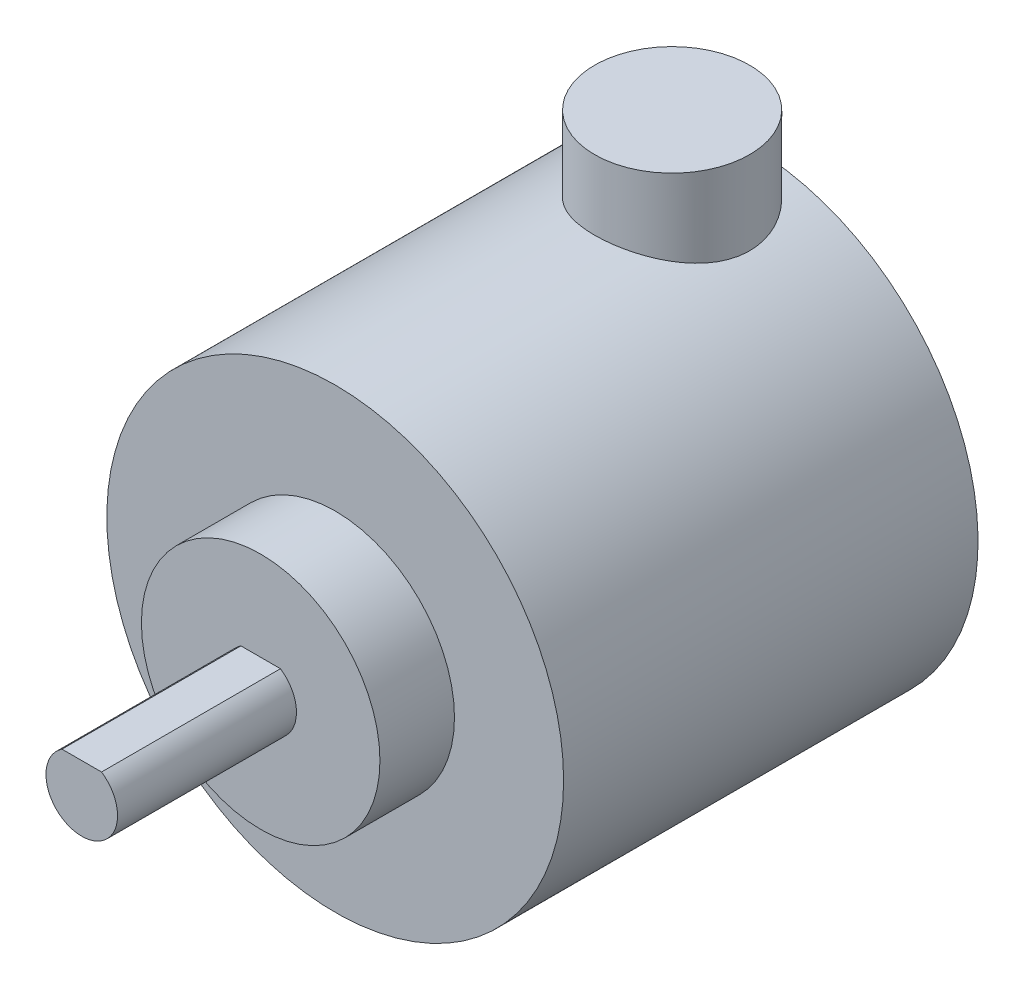
ISO-10303-21;
HEADER;
FILE_DESCRIPTION(('STEP AP214'),'2;1');
FILE_NAME('part.step','',(''),(''),'','','');
FILE_SCHEMA(('AUTOMOTIVE_DESIGN { 1 0 10303 214 1 1 1 1 }'));
ENDSEC;
DATA;
#1=APPLICATION_CONTEXT('core data for automotive mechanical design processes');
#2=APPLICATION_PROTOCOL_DEFINITION('international standard','automotive_design',2000,#1);
#3=PRODUCT_CONTEXT('',#1,'mechanical');
#4=PRODUCT('Part','Part','',(#3));
#5=PRODUCT_RELATED_PRODUCT_CATEGORY('part','',(#4));
#6=PRODUCT_DEFINITION_FORMATION('','',#4);
#7=PRODUCT_DEFINITION_CONTEXT('part definition',#1,'design');
#8=PRODUCT_DEFINITION('design','',#6,#7);
#9=PRODUCT_DEFINITION_SHAPE('','',#8);
#10=(LENGTH_UNIT() NAMED_UNIT(*) SI_UNIT(.MILLI.,.METRE.));
#11=(NAMED_UNIT(*) PLANE_ANGLE_UNIT() SI_UNIT($,.RADIAN.));
#12=(NAMED_UNIT(*) SI_UNIT($,.STERADIAN.) SOLID_ANGLE_UNIT());
#13=UNCERTAINTY_MEASURE_WITH_UNIT(LENGTH_MEASURE(1.E-05),#10,'distance_accuracy_value','');
#14=(GEOMETRIC_REPRESENTATION_CONTEXT(3) GLOBAL_UNCERTAINTY_ASSIGNED_CONTEXT((#13)) GLOBAL_UNIT_ASSIGNED_CONTEXT((#10,
#11,#12)) REPRESENTATION_CONTEXT('',''));
#15=CARTESIAN_POINT('',(0.,0.,0.));
#16=DIRECTION('',(0.,0.,1.));
#17=DIRECTION('',(1.,0.,0.));
#18=AXIS2_PLACEMENT_3D('',#15,#16,#17);
#19=CARTESIAN_POINT('',(0.,0.,34.75));
#20=DIRECTION('',(0.,0.,-1.));
#21=DIRECTION('',(-1.,0.,0.));
#22=AXIS2_PLACEMENT_3D('',#19,#20,#21);
#23=CYLINDRICAL_SURFACE('',#22,19.15);
#24=CARTESIAN_POINT('',(0.,0.,34.75));
#25=DIRECTION('',(0.,0.,1.));
#26=DIRECTION('',(1.,0.,0.));
#27=AXIS2_PLACEMENT_3D('',#24,#25,#26);
#28=CIRCLE('',#27,19.15);
#29=CARTESIAN_POINT('',(19.15,0.,34.75));
#30=VERTEX_POINT('',#29);
#31=EDGE_CURVE('E84',#30,#30,#28,.T.);
#32=ORIENTED_EDGE('',*,*,#31,.F.);
#33=EDGE_LOOP('',(#32));
#34=FACE_BOUND('',#33,.T.);
#35=CARTESIAN_POINT('',(0.,0.,0.));
#36=DIRECTION('',(0.,0.,1.));
#37=DIRECTION('',(1.,0.,0.));
#38=AXIS2_PLACEMENT_3D('',#35,#36,#37);
#39=CIRCLE('',#38,19.15);
#40=CARTESIAN_POINT('',(0.,19.15,0.));
#41=VERTEX_POINT('',#40);
#42=EDGE_CURVE('E52',#41,#41,#39,.T.);
#43=ORIENTED_EDGE('',*,*,#42,.T.);
#44=CARTESIAN_POINT('',(0.,19.15,0.));
#45=CARTESIAN_POINT('',(-0.177111806790201,19.1500001130655,-1.66143290630455E-07));
#46=CARTESIAN_POINT('',(-0.354221122925907,19.1475373566144,0.00724466132958994));
#47=CARTESIAN_POINT('',(-0.707186463893901,19.137752428606,0.0361580254000941));
#48=CARTESIAN_POINT('',(-0.883042019638498,19.1304285257543,0.0578317008311467));
#49=CARTESIAN_POINT('',(-1.23208834398768,19.1111224830327,0.115390701174901));
#50=CARTESIAN_POINT('',(-1.40527997714656,19.0991418890927,0.151271309738562));
#51=CARTESIAN_POINT('',(-1.74789660425077,19.0708394765471,0.236929554055904));
#52=CARTESIAN_POINT('',(-1.91732011458658,19.0545159797026,0.286712562519166));
#53=CARTESIAN_POINT('',(-2.25082328570757,19.0180014141644,0.399612895389175));
#54=CARTESIAN_POINT('',(-2.4149135525972,18.9978186509517,0.462701614224992));
#55=CARTESIAN_POINT('',(-2.73713045356237,18.9540777781514,0.601786559133724));
#56=CARTESIAN_POINT('',(-2.89525485384683,18.9305184198074,0.677787562456081));
#57=CARTESIAN_POINT('',(-3.2044775544452,18.8806342280472,0.842087675630392));
#58=CARTESIAN_POINT('',(-3.35557724103923,18.8543099436414,0.930384345155936));
#59=CARTESIAN_POINT('',(-3.64995300866277,18.7995417308819,1.11870035402043));
#60=CARTESIAN_POINT('',(-3.79322625276099,18.7710970426429,1.21872390332772));
#61=CARTESIAN_POINT('',(-4.07553883418773,18.7118665115558,1.43320539488021));
#62=CARTESIAN_POINT('',(-4.21429518213755,18.6810348484503,1.54802328793073));
#63=CARTESIAN_POINT('',(-4.48172691406864,18.6186863261704,1.78868536272117));
#64=CARTESIAN_POINT('',(-4.61040206442189,18.587169451138,1.91452979985408));
#65=CARTESIAN_POINT('',(-4.85694557689182,18.5242752612902,2.17652364944316));
#66=CARTESIAN_POINT('',(-4.97480966194558,18.4928980063423,2.31267710178803));
#67=CARTESIAN_POINT('',(-5.198898669749,18.4311545716468,2.59438407569285));
#68=CARTESIAN_POINT('',(-5.30512756147663,18.4007880495957,2.73993436472156));
#69=CARTESIAN_POINT('',(-5.50834251351435,18.3409984516939,3.04418766087037));
#70=CARTESIAN_POINT('',(-5.60494811172167,18.3116323525251,3.20315635600638));
#71=CARTESIAN_POINT('',(-5.784327213181,18.2557630643612,3.52911617865274));
#72=CARTESIAN_POINT('',(-5.86710618641379,18.2292587446856,3.69610409983684));
#73=CARTESIAN_POINT('',(-6.01820011699551,18.1799364410917,4.03706629645715));
#74=CARTESIAN_POINT('',(-6.08651262865373,18.1571190806425,4.21104174729559));
#75=CARTESIAN_POINT('',(-6.20800072818505,18.1159417403308,4.56463093000764));
#76=CARTESIAN_POINT('',(-6.26118326769804,18.097579713986,4.74424203026254));
#77=CARTESIAN_POINT('',(-6.35036186926822,18.0664760858681,5.1015590793628));
#78=CARTESIAN_POINT('',(-6.38688571772156,18.0535630296016,5.27911840248297));
#79=CARTESIAN_POINT('',(-6.44498811999897,18.0329027687945,5.63689171725841));
#80=CARTESIAN_POINT('',(-6.46657294603764,18.0251533963092,5.81710456232431));
#81=CARTESIAN_POINT('',(-6.49459504340378,18.0150758530907,6.17884148015608));
#82=CARTESIAN_POINT('',(-6.50103351936509,18.0127472512278,6.36036544749262));
#83=CARTESIAN_POINT('',(-6.49869725202439,18.0135903349873,6.72329978742619));
#84=CARTESIAN_POINT('',(-6.48992295891756,18.0167618578433,6.90471016322584));
#85=CARTESIAN_POINT('',(-6.45803966699562,18.0282137305565,7.25733060394627));
#86=CARTESIAN_POINT('',(-6.43563689030269,18.036242284183,7.4286132902002));
#87=CARTESIAN_POINT('',(-6.37732867264082,18.0569414696561,7.76863805767904));
#88=CARTESIAN_POINT('',(-6.34141869579503,18.0696136608538,7.93737926562605));
#89=CARTESIAN_POINT('',(-6.25643117798308,18.0992151639767,8.27107496639378));
#90=CARTESIAN_POINT('',(-6.20735728893636,18.1161432951416,8.43603049567701));
#91=CARTESIAN_POINT('',(-6.09642999454602,18.1537728680482,8.76120889329794));
#92=CARTESIAN_POINT('',(-6.03457173159021,18.1744757437068,8.92142993617091));
#93=CARTESIAN_POINT('',(-5.89746997382135,18.2194300919505,9.23864646045242));
#94=CARTESIAN_POINT('',(-5.82202649412646,18.2437334613008,9.3955480985802));
#95=CARTESIAN_POINT('',(-5.65898313496542,18.2949640784044,9.70251863617628));
#96=CARTESIAN_POINT('',(-5.57137910502573,18.321892221071,9.85258517945897));
#97=CARTESIAN_POINT('',(-5.38462039213438,18.3776455829498,10.1449911880121));
#98=CARTESIAN_POINT('',(-5.28546484117394,18.4064709446525,10.2873300714282));
#99=CARTESIAN_POINT('',(-5.07622773739983,18.4652706321871,10.5634868865268));
#100=CARTESIAN_POINT('',(-4.96614578332265,18.4952450001906,10.6973045049761));
#101=CARTESIAN_POINT('',(-4.72941858108454,18.557232289174,10.9627255409414));
#102=CARTESIAN_POINT('',(-4.60219763656238,18.5892672886008,11.0938109313744));
#103=CARTESIAN_POINT('',(-4.33716305152147,18.6528839716768,11.3448240594946));
#104=CARTESIAN_POINT('',(-4.1993527449162,18.6844657943164,11.464755282845));
#105=CARTESIAN_POINT('',(-3.91387634611394,18.7463438912748,11.6927795422505));
#106=CARTESIAN_POINT('',(-3.76620552531858,18.7766395372514,11.8008668319865));
#107=CARTESIAN_POINT('',(-3.46204044821912,18.835093474582,12.0043384021524));
#108=CARTESIAN_POINT('',(-3.30554972208709,18.8632526106349,12.0997277142778));
#109=CARTESIAN_POINT('',(-2.98290480538652,18.9169716181894,12.2781167095126));
#110=CARTESIAN_POINT('',(-2.81666273322922,18.9424992212899,12.3609673529421));
#111=CARTESIAN_POINT('',(-2.47731680886053,18.9898587414933,12.5122706474753));
#112=CARTESIAN_POINT('',(-2.30421565665065,19.0116920953064,12.580728898369));
#113=CARTESIAN_POINT('',(-1.95234941332479,19.0510410415853,12.7026604469698));
#114=CARTESIAN_POINT('',(-1.7735848400158,19.06855702751,12.7561351102514));
#115=CARTESIAN_POINT('',(-1.41173548621425,19.0987553539006,12.8475839607109));
#116=CARTESIAN_POINT('',(-1.22865091314283,19.1114379259393,12.8855588904999));
#117=CARTESIAN_POINT('',(-0.867878199422217,19.1311382640974,12.9442749149077));
#118=CARTESIAN_POINT('',(-0.690315446364259,19.1383842313722,12.9657114780425));
#119=CARTESIAN_POINT('',(-0.333896743918231,19.1479186639145,12.993879155518));
#120=CARTESIAN_POINT('',(-0.155040836973554,19.1502072911555,13.000610750321));
#121=CARTESIAN_POINT('',(0.202581812778011,19.1497632030357,12.9993023207749));
#122=CARTESIAN_POINT('',(0.381348565115335,19.1470312669726,12.9912645889379));
#123=CARTESIAN_POINT('',(0.73746663723116,19.1366238947675,12.9605017980466));
#124=CARTESIAN_POINT('',(0.914817972200623,19.1289485117533,12.9377768968375));
#125=CARTESIAN_POINT('',(1.26141502338232,19.1091743291602,12.8787764369005));
#126=CARTESIAN_POINT('',(1.43074303111326,19.0972174913317,12.8429350306727));
#127=CARTESIAN_POINT('',(1.76573680447721,19.0691619107638,12.7579584560627));
#128=CARTESIAN_POINT('',(1.93140133304751,19.0530617914545,12.7088188691928));
#129=CARTESIAN_POINT('',(2.25788713133803,19.0171347167937,12.5976778770325));
#130=CARTESIAN_POINT('',(2.41870968824139,18.9973087622458,12.5356799251893));
#131=CARTESIAN_POINT('',(2.7346223428478,18.9544127927023,12.3992758343841));
#132=CARTESIAN_POINT('',(2.88971024432214,18.9313415507654,12.3248650005142));
#133=CARTESIAN_POINT('',(3.19719470243346,18.8818784226713,12.1620670874994));
#134=CARTESIAN_POINT('',(3.34941151985061,18.8554148359072,12.0733623455951));
#135=CARTESIAN_POINT('',(3.64592436373912,18.8003320811628,11.8840678221434));
#136=CARTESIAN_POINT('',(3.79021763506824,18.7717121714978,11.7834739444045));
#137=CARTESIAN_POINT('',(4.07001601694165,18.7130410882033,11.5710770809549));
#138=CARTESIAN_POINT('',(4.20552020777268,18.6829897653556,11.4592729252768));
#139=CARTESIAN_POINT('',(4.46695961711257,18.6222122001711,11.2251523899952));
#140=CARTESIAN_POINT('',(4.59289457160932,18.5914859392432,11.1028357205531));
#141=CARTESIAN_POINT('',(4.84020963332944,18.5286781254429,10.8423648990324));
#142=CARTESIAN_POINT('',(4.96109016103401,18.496601435632,10.7037346779743));
#143=CARTESIAN_POINT('',(5.19073527327617,18.4334735758231,10.4166372565163));
#144=CARTESIAN_POINT('',(5.29950384819835,18.4024220704556,10.2681733217779));
#145=CARTESIAN_POINT('',(5.50426584321646,18.3422178170627,9.96221812403002));
#146=CARTESIAN_POINT('',(5.6002537726911,18.313065887832,9.8047230224935));
#147=CARTESIAN_POINT('',(5.77864218053168,18.2575606707396,9.48182824930424));
#148=CARTESIAN_POINT('',(5.86104832944451,18.2312062165447,9.31643191389917));
#149=CARTESIAN_POINT('',(6.01158016622488,18.1821250317741,8.97891440463895));
#150=CARTESIAN_POINT('',(6.0797182569993,18.1593951545678,8.80679922705975));
#151=CARTESIAN_POINT('',(6.20116737744665,18.1182818388262,8.45698407437394));
#152=CARTESIAN_POINT('',(6.25448452700752,18.0998966067642,8.27928643822244));
#153=CARTESIAN_POINT('',(6.34579988263735,18.0680841606849,7.91959349039022));
#154=CARTESIAN_POINT('',(6.38380095788544,18.0546560180895,7.73759899041474));
#155=CARTESIAN_POINT('',(6.44409901153872,18.033222589254,7.37071369393047));
#156=CARTESIAN_POINT('',(6.46639682122312,18.0252170159618,7.18582305126371));
#157=CARTESIAN_POINT('',(6.49428165349164,18.0151882900984,6.82457882516764));
#158=CARTESIAN_POINT('',(6.50069798011711,18.01286831443,6.64829700562519));
#159=CARTESIAN_POINT('',(6.49918156547928,18.0134155878694,6.29574048829984));
#160=CARTESIAN_POINT('',(6.49124395247405,18.0162845981244,6.11946581324859));
#161=CARTESIAN_POINT('',(6.46109617645081,18.0271181988721,5.7683807849582));
#162=CARTESIAN_POINT('',(6.4388923044976,18.0350805433246,5.59356982066361));
#163=CARTESIAN_POINT('',(6.38042453587455,18.0558478979497,5.24654227698688));
#164=CARTESIAN_POINT('',(6.34415535600666,18.068654727759,5.07432669776248));
#165=CARTESIAN_POINT('',(6.25879860412994,18.0983959205114,4.73732501634808));
#166=CARTESIAN_POINT('',(6.20999431458919,18.1152385750117,4.57245887124062));
#167=CARTESIAN_POINT('',(6.09962440173799,18.15269887753,4.24743502209273));
#168=CARTESIAN_POINT('',(6.0380542584946,18.173317862309,4.08727900873745));
#169=CARTESIAN_POINT('',(5.90265482090694,18.2177451443301,3.77273395992094));
#170=CARTESIAN_POINT('',(5.82882769495815,18.2415528773036,3.61834391030455));
#171=CARTESIAN_POINT('',(5.66940755570187,18.2917276504752,3.31613169968525));
#172=CARTESIAN_POINT('',(5.58381030981787,18.318095610333,3.16831192679507));
#173=CARTESIAN_POINT('',(5.39734437098456,18.3739234097322,2.87364954905835));
#174=CARTESIAN_POINT('',(5.29596345370782,18.403468830553,2.72714714084008));
#175=CARTESIAN_POINT('',(5.08166179090383,18.4637916356801,2.44310865627632));
#176=CARTESIAN_POINT('',(4.9687406280322,18.4945690645166,2.30557290449809));
#177=CARTESIAN_POINT('',(4.7320089542554,18.5565504535429,2.04021092378697));
#178=CARTESIAN_POINT('',(4.60819383443073,18.5877545894993,1.91238884746634));
#179=CARTESIAN_POINT('',(4.35049354283668,18.6497523152396,1.66731813803294));
#180=CARTESIAN_POINT('',(4.21661165995459,18.6805460352721,1.55006607890805));
#181=CARTESIAN_POINT('',(3.9337714898634,18.742191551936,1.32218448576877));
#182=CARTESIAN_POINT('',(3.78441836399195,18.7729928838616,1.21203067857626));
#183=CARTESIAN_POINT('',(3.47659838854036,18.8324274133069,1.00475849512041));
#184=CARTESIAN_POINT('',(3.31813497510173,18.8610614189625,0.907635249581585));
#185=CARTESIAN_POINT('',(2.99303649524318,18.9153745523958,0.727105638748167));
#186=CARTESIAN_POINT('',(2.8263994253573,18.941052950503,0.643702658494676));
#187=CARTESIAN_POINT('',(2.48620386322742,18.988701152453,0.4913807253735));
#188=CARTESIAN_POINT('',(2.31264849273747,19.0106726060826,0.422455325850975));
#189=CARTESIAN_POINT('',(1.96547333202913,19.0496440785349,0.301645130926614));
#190=CARTESIAN_POINT('',(1.79203461043261,19.0667810940332,0.249284164987416));
#191=CARTESIAN_POINT('',(1.4410907710342,19.0965114824409,0.15917501287733));
#192=CARTESIAN_POINT('',(1.26358735882104,19.1091067252757,0.121420812383278));
#193=CARTESIAN_POINT('',(0.905780207610436,19.129405855333,0.0608631522531734));
#194=CARTESIAN_POINT('',(0.725476630818803,19.1371100248071,0.0380588298942887));
#195=CARTESIAN_POINT('',(0.363447812838707,19.147406996518,0.00762746554868549));
#196=CARTESIAN_POINT('',(0.181722595408385,19.149999883991,1.70468533579017E-07));
#197=CARTESIAN_POINT('',(0.,19.15,0.));
#198=B_SPLINE_CURVE_WITH_KNOTS('',3,(#44,#45,#46,#47,#48,#49,#50,#51,#52,#53,#54,#55,#56,#57,
#58,#59,#60,#61,#62,#63,#64,#65,#66,#67,#68,#69,#70,#71,#72,#73,#74,#75,#76,#77,#78,#79,#80,#81,
#82,#83,#84,#85,#86,#87,#88,#89,#90,#91,#92,#93,#94,#95,#96,#97,#98,#99,#100,#101,#102,#103,
#104,#105,#106,#107,#108,#109,#110,#111,#112,#113,#114,#115,#116,#117,#118,#119,#120,#121,#122,
#123,#124,#125,#126,#127,#128,#129,#130,#131,#132,#133,#134,#135,#136,#137,#138,#139,#140,#141,
#142,#143,#144,#145,#146,#147,#148,#149,#150,#151,#152,#153,#154,#155,#156,#157,#158,#159,#160,
#161,#162,#163,#164,#165,#166,#167,#168,#169,#170,#171,#172,#173,#174,#175,#176,#177,#178,#179,
#180,#181,#182,#183,#184,#185,#186,#187,#188,#189,#190,#191,#192,#193,#194,#195,#196,#197),
.UNSPECIFIED.,.T.,.F.,(4,2,2,2,2,2,2,2,2,2,2,2,2,2,2,2,2,2,2,2,2,2,2,2,2,2,2,2,2,2,2,2,2,2,2,2,
2,2,2,2,2,2,2,2,2,2,2,2,2,2,2,2,2,2,2,2,2,2,2,2,2,2,2,2,2,2,2,2,2,2,2,2,2,2,2,2,4),(0.,
0.53116670615186,1.06252268857399,1.59370242170093,2.12508771885151,2.65534204332686,
3.18579297868396,3.71613878485601,4.24667557239907,4.79422088866785,5.34177889034522,
5.88955259038764,6.43713884897043,7.00141730400315,7.56547199216044,8.12962196304863,
8.69351230856244,9.23802542956976,9.78230979542315,10.3265508712736,10.8707758415406,
11.3889518774987,11.9073020786496,12.4255086280544,12.9439124409094,13.4706860814257,
13.9976399572505,14.5246334552146,15.0516463137639,15.6073776509677,16.1629347351685,
16.7187601765005,17.2743647068396,17.836127326908,18.3976709702877,18.9591634190279,
19.5206289628215,20.0569566845676,20.5932668823694,21.1294938405095,21.6657150358357,
22.1855916226842,22.7056411575957,23.2255512001748,23.7456583353691,24.2795248467828,
24.8135758316128,25.3476826111293,25.8818041211305,26.44126675686,27.0005445241582,
27.5600617896991,28.1193448554198,28.6781397117892,29.2367034857322,29.7951625745441,
30.3535920981467,30.8821807688943,31.4109488768551,31.9394839711379,32.4682177858789,
32.9859182048355,33.5038022369992,34.0215947472013,34.5395739467448,35.0807491176544,
35.6219438666897,36.1633686908315,36.7046173896236,37.2682932984924,37.8317579821096,
38.395361474982,38.958713468932,39.5039734427333,40.0490086666633,40.5940124351039,
41.1390071149379),.UNSPECIFIED.);
#199=EDGE_CURVE('E150',#41,#41,#198,.T.);
#200=ORIENTED_EDGE('',*,*,#199,.F.);
#201=EDGE_LOOP('',(#43,#200));
#202=FACE_BOUND('',#201,.T.);
#203=ADVANCED_FACE('F48',(#34,#202),#23,.T.);
#204=CARTESIAN_POINT('',(0.,0.,34.75));
#205=DIRECTION('',(0.,0.,1.));
#206=DIRECTION('',(1.,0.,0.));
#207=AXIS2_PLACEMENT_3D('',#204,#205,#206);
#208=PLANE('',#207);
#209=CARTESIAN_POINT('',(0.,0.,34.75));
#210=DIRECTION('',(0.,0.,1.));
#211=DIRECTION('',(1.,0.,0.));
#212=AXIS2_PLACEMENT_3D('',#209,#210,#211);
#213=CIRCLE('',#212,10.);
#214=CARTESIAN_POINT('',(10.,0.,34.75));
#215=VERTEX_POINT('',#214);
#216=EDGE_CURVE('E57',#215,#215,#213,.T.);
#217=ORIENTED_EDGE('',*,*,#216,.F.);
#218=EDGE_LOOP('',(#217));
#219=FACE_BOUND('',#218,.T.);
#220=ORIENTED_EDGE('',*,*,#31,.T.);
#221=EDGE_LOOP('',(#220));
#222=FACE_BOUND('',#221,.T.);
#223=ADVANCED_FACE('F100',(#219,#222),#208,.T.);
#224=CARTESIAN_POINT('',(0.,0.,0.));
#225=DIRECTION('',(0.,0.,1.));
#226=DIRECTION('',(1.,0.,0.));
#227=AXIS2_PLACEMENT_3D('',#224,#225,#226);
#228=PLANE('',#227);
#229=ORIENTED_EDGE('',*,*,#42,.F.);
#230=EDGE_LOOP('',(#229));
#231=FACE_BOUND('',#230,.T.);
#232=ADVANCED_FACE('F81',(#231),#228,.F.);
#233=CARTESIAN_POINT('',(0.,0.,41.));
#234=DIRECTION('',(0.,0.,-1.));
#235=DIRECTION('',(-1.,0.,0.));
#236=AXIS2_PLACEMENT_3D('',#233,#234,#235);
#237=CYLINDRICAL_SURFACE('',#236,10.);
#238=CARTESIAN_POINT('',(0.,0.,41.));
#239=DIRECTION('',(0.,0.,1.));
#240=DIRECTION('',(1.,0.,0.));
#241=AXIS2_PLACEMENT_3D('',#238,#239,#240);
#242=CIRCLE('',#241,10.);
#243=CARTESIAN_POINT('',(10.,0.,41.));
#244=VERTEX_POINT('',#243);
#245=EDGE_CURVE('E85',#244,#244,#242,.T.);
#246=ORIENTED_EDGE('',*,*,#245,.F.);
#247=EDGE_LOOP('',(#246));
#248=FACE_BOUND('',#247,.T.);
#249=ORIENTED_EDGE('',*,*,#216,.T.);
#250=EDGE_LOOP('',(#249));
#251=FACE_BOUND('',#250,.T.);
#252=ADVANCED_FACE('F98',(#248,#251),#237,.T.);
#253=CARTESIAN_POINT('',(0.,0.,41.));
#254=DIRECTION('',(0.,0.,1.));
#255=DIRECTION('',(1.,0.,0.));
#256=AXIS2_PLACEMENT_3D('',#253,#254,#255);
#257=PLANE('',#256);
#258=CARTESIAN_POINT('',(0.,0.,41.));
#259=DIRECTION('',(0.,0.,1.));
#260=DIRECTION('',(1.,0.,0.));
#261=AXIS2_PLACEMENT_3D('',#258,#259,#260);
#262=CIRCLE('',#261,3.);
#263=CARTESIAN_POINT('',(-1.6583123951777,2.5,41.));
#264=VERTEX_POINT('',#263);
#265=CARTESIAN_POINT('',(1.6583123951777,2.5,41.));
#266=VERTEX_POINT('',#265);
#267=EDGE_CURVE('E11',#264,#266,#262,.T.);
#268=ORIENTED_EDGE('',*,*,#267,.F.);
#269=DIRECTION('',(1.,0.,0.));
#270=VECTOR('',#269,1.);
#271=CARTESIAN_POINT('',(-1.6583123951777,2.5,41.));
#272=LINE('',#271,#270);
#273=EDGE_CURVE('E158',#264,#266,#272,.T.);
#274=ORIENTED_EDGE('',*,*,#273,.T.);
#275=EDGE_LOOP('',(#268,#274));
#276=FACE_BOUND('',#275,.T.);
#277=ORIENTED_EDGE('',*,*,#245,.T.);
#278=EDGE_LOOP('',(#277));
#279=FACE_BOUND('',#278,.T.);
#280=ADVANCED_FACE('F171',(#276,#279),#257,.T.);
#281=CARTESIAN_POINT('',(0.,0.,56.));
#282=DIRECTION('',(0.,0.,-1.));
#283=DIRECTION('',(-1.,0.,0.));
#284=AXIS2_PLACEMENT_3D('',#281,#282,#283);
#285=CYLINDRICAL_SURFACE('',#284,3.);
#286=CARTESIAN_POINT('',(0.,0.,56.));
#287=DIRECTION('',(0.,0.,1.));
#288=DIRECTION('',(1.,0.,0.));
#289=AXIS2_PLACEMENT_3D('',#286,#287,#288);
#290=CIRCLE('',#289,3.);
#291=CARTESIAN_POINT('',(-1.6583123951777,2.5,56.));
#292=VERTEX_POINT('',#291);
#293=CARTESIAN_POINT('',(1.6583123951777,2.5,56.));
#294=VERTEX_POINT('',#293);
#295=EDGE_CURVE('E88',#292,#294,#290,.T.);
#296=ORIENTED_EDGE('',*,*,#295,.F.);
#297=DIRECTION('',(0.,0.,1.));
#298=VECTOR('',#297,1.);
#299=CARTESIAN_POINT('',(-1.6583123951777,2.5,41.));
#300=LINE('',#299,#298);
#301=EDGE_CURVE('E65',#264,#292,#300,.T.);
#302=ORIENTED_EDGE('',*,*,#301,.F.);
#303=ORIENTED_EDGE('',*,*,#267,.T.);
#304=DIRECTION('',(0.,0.,1.));
#305=VECTOR('',#304,1.);
#306=CARTESIAN_POINT('',(1.6583123951777,2.5,41.));
#307=LINE('',#306,#305);
#308=EDGE_CURVE('E71',#266,#294,#307,.T.);
#309=ORIENTED_EDGE('',*,*,#308,.T.);
#310=EDGE_LOOP('',(#296,#302,#303,#309));
#311=FACE_BOUND('',#310,.T.);
#312=ADVANCED_FACE('F164',(#311),#285,.T.);
#313=CARTESIAN_POINT('',(0.,0.,56.));
#314=DIRECTION('',(0.,0.,1.));
#315=DIRECTION('',(1.,0.,0.));
#316=AXIS2_PLACEMENT_3D('',#313,#314,#315);
#317=PLANE('',#316);
#318=DIRECTION('',(1.,0.,0.));
#319=VECTOR('',#318,1.);
#320=CARTESIAN_POINT('',(-1.6583123951777,2.5,56.));
#321=LINE('',#320,#319);
#322=EDGE_CURVE('E77',#292,#294,#321,.T.);
#323=ORIENTED_EDGE('',*,*,#322,.F.);
#324=ORIENTED_EDGE('',*,*,#295,.T.);
#325=EDGE_LOOP('',(#323,#324));
#326=FACE_BOUND('',#325,.T.);
#327=ADVANCED_FACE('F167',(#326),#317,.T.);
#328=CARTESIAN_POINT('',(-1.6583123951777,2.5,41.));
#329=DIRECTION('',(0.,-1.,0.));
#330=DIRECTION('',(0.,0.,-1.));
#331=AXIS2_PLACEMENT_3D('',#328,#329,#330);
#332=PLANE('',#331);
#333=ORIENTED_EDGE('',*,*,#322,.T.);
#334=ORIENTED_EDGE('',*,*,#308,.F.);
#335=ORIENTED_EDGE('',*,*,#273,.F.);
#336=ORIENTED_EDGE('',*,*,#301,.T.);
#337=EDGE_LOOP('',(#333,#334,#335,#336));
#338=FACE_BOUND('',#337,.T.);
#339=ADVANCED_FACE('F115',(#338),#332,.F.);
#340=CARTESIAN_POINT('',(0.,25.,6.5));
#341=DIRECTION('',(0.,-1.,0.));
#342=DIRECTION('',(0.,0.,-1.));
#343=AXIS2_PLACEMENT_3D('',#340,#341,#342);
#344=CYLINDRICAL_SURFACE('',#343,6.5);
#345=CARTESIAN_POINT('',(0.,25.,6.5));
#346=DIRECTION('',(0.,1.,0.));
#347=DIRECTION('',(0.,0.,1.));
#348=AXIS2_PLACEMENT_3D('',#345,#346,#347);
#349=CIRCLE('',#348,6.5);
#350=CARTESIAN_POINT('',(0.,25.,13.));
#351=VERTEX_POINT('',#350);
#352=EDGE_CURVE('E157',#351,#351,#349,.T.);
#353=ORIENTED_EDGE('',*,*,#352,.F.);
#354=EDGE_LOOP('',(#353));
#355=FACE_BOUND('',#354,.T.);
#356=ORIENTED_EDGE('',*,*,#199,.T.);
#357=EDGE_LOOP('',(#356));
#358=FACE_BOUND('',#357,.T.);
#359=ADVANCED_FACE('F127',(#355,#358),#344,.T.);
#360=CARTESIAN_POINT('',(0.,25.,6.5));
#361=DIRECTION('',(0.,1.,0.));
#362=DIRECTION('',(0.,0.,1.));
#363=AXIS2_PLACEMENT_3D('',#360,#361,#362);
#364=PLANE('',#363);
#365=ORIENTED_EDGE('',*,*,#352,.T.);
#366=EDGE_LOOP('',(#365));
#367=FACE_BOUND('',#366,.T.);
#368=ADVANCED_FACE('F131',(#367),#364,.T.);
#369=CLOSED_SHELL('',(#203,#223,#232,#252,#280,#312,#327,#339,#359,#368));
#370=MANIFOLD_SOLID_BREP('B2',#369);
#371=ADVANCED_BREP_SHAPE_REPRESENTATION('',(#18,#370),#14);
#372=SHAPE_DEFINITION_REPRESENTATION(#9,#371);
ENDSEC;
END-ISO-10303-21;
